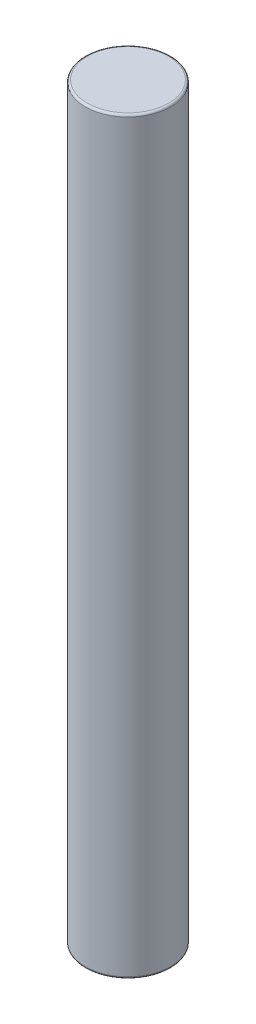
ISO-10303-21;
HEADER;
FILE_DESCRIPTION(('STEP AP214'),'2;1');
FILE_NAME('part.step','',(''),(''),'','','');
FILE_SCHEMA(('AUTOMOTIVE_DESIGN { 1 0 10303 214 1 1 1 1 }'));
ENDSEC;
DATA;
#1=APPLICATION_CONTEXT('core data for automotive mechanical design processes');
#2=APPLICATION_PROTOCOL_DEFINITION('international standard','automotive_design',2000,#1);
#3=PRODUCT_CONTEXT('',#1,'mechanical');
#4=PRODUCT('Part','Part','',(#3));
#5=PRODUCT_RELATED_PRODUCT_CATEGORY('part','',(#4));
#6=PRODUCT_DEFINITION_FORMATION('','',#4);
#7=PRODUCT_DEFINITION_CONTEXT('part definition',#1,'design');
#8=PRODUCT_DEFINITION('design','',#6,#7);
#9=PRODUCT_DEFINITION_SHAPE('','',#8);
#10=(LENGTH_UNIT() NAMED_UNIT(*) SI_UNIT(.MILLI.,.METRE.));
#11=(NAMED_UNIT(*) PLANE_ANGLE_UNIT() SI_UNIT($,.RADIAN.));
#12=(NAMED_UNIT(*) SI_UNIT($,.STERADIAN.) SOLID_ANGLE_UNIT());
#13=UNCERTAINTY_MEASURE_WITH_UNIT(LENGTH_MEASURE(1.E-05),#10,'distance_accuracy_value','');
#14=(GEOMETRIC_REPRESENTATION_CONTEXT(3) GLOBAL_UNCERTAINTY_ASSIGNED_CONTEXT((#13)) GLOBAL_UNIT_ASSIGNED_CONTEXT((#10,
#11,#12)) REPRESENTATION_CONTEXT('',''));
#15=CARTESIAN_POINT('',(0.,0.,0.));
#16=DIRECTION('',(0.,0.,1.));
#17=DIRECTION('',(1.,0.,0.));
#18=AXIS2_PLACEMENT_3D('',#15,#16,#17);
#19=CARTESIAN_POINT('',(0.,70.,0.));
#20=DIRECTION('',(0.,-1.,0.));
#21=DIRECTION('',(0.,0.,-1.));
#22=AXIS2_PLACEMENT_3D('',#19,#20,#21);
#23=CYLINDRICAL_SURFACE('',#22,4.);
#24=CARTESIAN_POINT('',(0.,0.200000000000006,0.));
#25=DIRECTION('',(0.,1.,0.));
#26=DIRECTION('',(0.,0.,1.));
#27=AXIS2_PLACEMENT_3D('',#24,#25,#26);
#28=CIRCLE('',#27,4.);
#29=CARTESIAN_POINT('',(0.,0.200000000000006,4.));
#30=VERTEX_POINT('',#29);
#31=EDGE_CURVE('E50',#30,#30,#28,.T.);
#32=ORIENTED_EDGE('',*,*,#31,.T.);
#33=EDGE_LOOP('',(#32));
#34=FACE_BOUND('',#33,.T.);
#35=CARTESIAN_POINT('',(0.,69.8,0.));
#36=DIRECTION('',(0.,1.,0.));
#37=DIRECTION('',(0.,0.,1.));
#38=AXIS2_PLACEMENT_3D('',#35,#36,#37);
#39=CIRCLE('',#38,4.);
#40=CARTESIAN_POINT('',(0.,69.8,4.));
#41=VERTEX_POINT('',#40);
#42=EDGE_CURVE('E55',#41,#41,#39,.F.);
#43=ORIENTED_EDGE('',*,*,#42,.T.);
#44=EDGE_LOOP('',(#43));
#45=FACE_BOUND('',#44,.T.);
#46=ADVANCED_FACE('F37',(#34,#45),#23,.T.);
#47=CARTESIAN_POINT('',(0.,70.,0.));
#48=DIRECTION('',(0.,1.,0.));
#49=DIRECTION('',(0.,0.,1.));
#50=AXIS2_PLACEMENT_3D('',#47,#48,#49);
#51=PLANE('',#50);
#52=CARTESIAN_POINT('',(0.,70.,0.));
#53=DIRECTION('',(0.,1.,0.));
#54=DIRECTION('',(0.,0.,1.));
#55=AXIS2_PLACEMENT_3D('',#52,#53,#54);
#56=CIRCLE('',#55,3.8);
#57=CARTESIAN_POINT('',(0.,70.,3.8));
#58=VERTEX_POINT('',#57);
#59=EDGE_CURVE('E10',#58,#58,#56,.T.);
#60=ORIENTED_EDGE('',*,*,#59,.T.);
#61=EDGE_LOOP('',(#60));
#62=FACE_BOUND('',#61,.T.);
#63=ADVANCED_FACE('F72',(#62),#51,.T.);
#64=CARTESIAN_POINT('',(0.,0.,0.));
#65=DIRECTION('',(0.,1.,0.));
#66=DIRECTION('',(0.,0.,1.));
#67=AXIS2_PLACEMENT_3D('',#64,#65,#66);
#68=PLANE('',#67);
#69=CARTESIAN_POINT('',(0.,0.,0.));
#70=DIRECTION('',(0.,1.,0.));
#71=DIRECTION('',(0.,0.,1.));
#72=AXIS2_PLACEMENT_3D('',#69,#70,#71);
#73=CIRCLE('',#72,3.8);
#74=CARTESIAN_POINT('',(0.,0.,3.8));
#75=VERTEX_POINT('',#74);
#76=EDGE_CURVE('E45',#75,#75,#73,.F.);
#77=ORIENTED_EDGE('',*,*,#76,.T.);
#78=EDGE_LOOP('',(#77));
#79=FACE_BOUND('',#78,.T.);
#80=ADVANCED_FACE('F69',(#79),#68,.F.);
#81=CARTESIAN_POINT('',(0.,0.200000000000006,0.));
#82=DIRECTION('',(0.,1.,0.));
#83=DIRECTION('',(0.,0.,1.));
#84=AXIS2_PLACEMENT_3D('',#81,#82,#83);
#85=TOROIDAL_SURFACE('',#84,3.8,0.2);
#86=ORIENTED_EDGE('',*,*,#76,.F.);
#87=EDGE_LOOP('',(#86));
#88=FACE_BOUND('',#87,.T.);
#89=ORIENTED_EDGE('',*,*,#31,.F.);
#90=EDGE_LOOP('',(#89));
#91=FACE_BOUND('',#90,.T.);
#92=ADVANCED_FACE('F65',(#88,#91),#85,.T.);
#93=CARTESIAN_POINT('',(0.,69.8,0.));
#94=DIRECTION('',(0.,1.,0.));
#95=DIRECTION('',(0.,0.,1.));
#96=AXIS2_PLACEMENT_3D('',#93,#94,#95);
#97=TOROIDAL_SURFACE('',#96,3.8,0.2);
#98=ORIENTED_EDGE('',*,*,#42,.F.);
#99=EDGE_LOOP('',(#98));
#100=FACE_BOUND('',#99,.T.);
#101=ORIENTED_EDGE('',*,*,#59,.F.);
#102=EDGE_LOOP('',(#101));
#103=FACE_BOUND('',#102,.T.);
#104=ADVANCED_FACE('F39',(#100,#103),#97,.T.);
#105=CLOSED_SHELL('',(#46,#63,#80,#92,#104));
#106=MANIFOLD_SOLID_BREP('B2',#105);
#107=ADVANCED_BREP_SHAPE_REPRESENTATION('',(#18,#106),#14);
#108=SHAPE_DEFINITION_REPRESENTATION(#9,#107);
ENDSEC;
END-ISO-10303-21;
